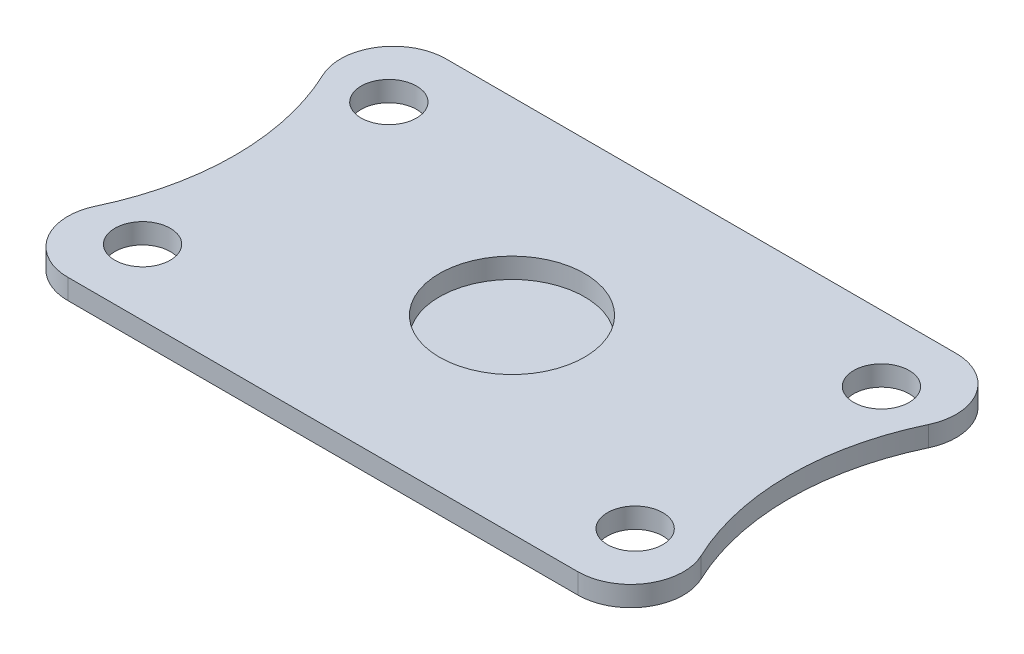
ISO-10303-21;
HEADER;
FILE_DESCRIPTION(('STEP AP214'),'2;1');
FILE_NAME('part.step','',(''),(''),'','','');
FILE_SCHEMA(('AUTOMOTIVE_DESIGN { 1 0 10303 214 1 1 1 1 }'));
ENDSEC;
DATA;
#1=APPLICATION_CONTEXT('core data for automotive mechanical design processes');
#2=APPLICATION_PROTOCOL_DEFINITION('international standard','automotive_design',2000,#1);
#3=PRODUCT_CONTEXT('',#1,'mechanical');
#4=PRODUCT('Part','Part','',(#3));
#5=PRODUCT_RELATED_PRODUCT_CATEGORY('part','',(#4));
#6=PRODUCT_DEFINITION_FORMATION('','',#4);
#7=PRODUCT_DEFINITION_CONTEXT('part definition',#1,'design');
#8=PRODUCT_DEFINITION('design','',#6,#7);
#9=PRODUCT_DEFINITION_SHAPE('','',#8);
#10=(LENGTH_UNIT() NAMED_UNIT(*) SI_UNIT(.MILLI.,.METRE.));
#11=(NAMED_UNIT(*) PLANE_ANGLE_UNIT() SI_UNIT($,.RADIAN.));
#12=(NAMED_UNIT(*) SI_UNIT($,.STERADIAN.) SOLID_ANGLE_UNIT());
#13=UNCERTAINTY_MEASURE_WITH_UNIT(LENGTH_MEASURE(1.E-05),#10,'distance_accuracy_value','');
#14=(GEOMETRIC_REPRESENTATION_CONTEXT(3) GLOBAL_UNCERTAINTY_ASSIGNED_CONTEXT((#13)) GLOBAL_UNIT_ASSIGNED_CONTEXT((#10,
#11,#12)) REPRESENTATION_CONTEXT('',''));
#15=CARTESIAN_POINT('',(0.,0.,0.));
#16=DIRECTION('',(0.,0.,1.));
#17=DIRECTION('',(1.,0.,0.));
#18=AXIS2_PLACEMENT_3D('',#15,#16,#17);
#19=CARTESIAN_POINT('',(-61.571428,2.3,0.));
#20=DIRECTION('',(0.,-1.,0.));
#21=DIRECTION('',(0.,0.,-1.));
#22=AXIS2_PLACEMENT_3D('',#19,#20,#21);
#23=CYLINDRICAL_SURFACE('',#22,30.0714280554455);
#24=CARTESIAN_POINT('',(-61.571428,0.,0.));
#25=DIRECTION('',(0.,1.,0.));
#26=DIRECTION('',(0.,0.,1.));
#27=AXIS2_PLACEMENT_3D('',#24,#25,#26);
#28=CIRCLE('',#27,30.0714280554455);
#29=CARTESIAN_POINT('',(-34.4178217988656,0.,12.9217822132844));
#30=VERTEX_POINT('',#29);
#31=CARTESIAN_POINT('',(-34.4178217988656,0.,-12.9217822132845));
#32=VERTEX_POINT('',#31);
#33=EDGE_CURVE('E147',#30,#32,#28,.T.);
#34=ORIENTED_EDGE('',*,*,#33,.F.);
#35=DIRECTION('',(0.,-1.,0.));
#36=VECTOR('',#35,1.);
#37=CARTESIAN_POINT('',(-34.4178217988656,2.3,12.9217822132844));
#38=LINE('',#37,#36);
#39=CARTESIAN_POINT('',(-34.4178217988656,2.3,12.9217822132844));
#40=VERTEX_POINT('',#39);
#41=EDGE_CURVE('E44',#40,#30,#38,.T.);
#42=ORIENTED_EDGE('',*,*,#41,.F.);
#43=CARTESIAN_POINT('',(-61.571428,2.3,0.));
#44=DIRECTION('',(0.,1.,0.));
#45=DIRECTION('',(0.,0.,1.));
#46=AXIS2_PLACEMENT_3D('',#43,#44,#45);
#47=CIRCLE('',#46,30.0714280554455);
#48=CARTESIAN_POINT('',(-34.4178217988656,2.3,-12.9217822132845));
#49=VERTEX_POINT('',#48);
#50=EDGE_CURVE('E269',#40,#49,#47,.T.);
#51=ORIENTED_EDGE('',*,*,#50,.T.);
#52=DIRECTION('',(0.,-1.,0.));
#53=VECTOR('',#52,1.);
#54=CARTESIAN_POINT('',(-34.4178217988656,2.3,-12.9217822132845));
#55=LINE('',#54,#53);
#56=EDGE_CURVE('E87',#49,#32,#55,.T.);
#57=ORIENTED_EDGE('',*,*,#56,.T.);
#58=EDGE_LOOP('',(#34,#42,#51,#57));
#59=FACE_BOUND('',#58,.T.);
#60=ADVANCED_FACE('F35',(#59),#23,.F.);
#61=CARTESIAN_POINT('',(-29.,2.3,15.5));
#62=DIRECTION('',(0.,-1.,0.));
#63=DIRECTION('',(0.,0.,-1.));
#64=AXIS2_PLACEMENT_3D('',#61,#62,#63);
#65=CYLINDRICAL_SURFACE('',#64,6.);
#66=CARTESIAN_POINT('',(-29.,0.,15.5));
#67=DIRECTION('',(0.,1.,0.));
#68=DIRECTION('',(0.,0.,1.));
#69=AXIS2_PLACEMENT_3D('',#66,#67,#68);
#70=CIRCLE('',#69,6.);
#71=CARTESIAN_POINT('',(-29.,0.,21.5));
#72=VERTEX_POINT('',#71);
#73=EDGE_CURVE('E150',#30,#72,#70,.T.);
#74=ORIENTED_EDGE('',*,*,#73,.T.);
#75=DIRECTION('',(0.,-1.,0.));
#76=VECTOR('',#75,1.);
#77=CARTESIAN_POINT('',(-29.,2.3,21.5));
#78=LINE('',#77,#76);
#79=CARTESIAN_POINT('',(-29.,2.3,21.5));
#80=VERTEX_POINT('',#79);
#81=EDGE_CURVE('E182',#80,#72,#78,.T.);
#82=ORIENTED_EDGE('',*,*,#81,.F.);
#83=CARTESIAN_POINT('',(-29.,2.3,15.5));
#84=DIRECTION('',(0.,1.,0.));
#85=DIRECTION('',(0.,0.,1.));
#86=AXIS2_PLACEMENT_3D('',#83,#84,#85);
#87=CIRCLE('',#86,6.);
#88=EDGE_CURVE('E189',#40,#80,#87,.T.);
#89=ORIENTED_EDGE('',*,*,#88,.F.);
#90=ORIENTED_EDGE('',*,*,#41,.T.);
#91=EDGE_LOOP('',(#74,#82,#89,#90));
#92=FACE_BOUND('',#91,.T.);
#93=ADVANCED_FACE('F186',(#92),#65,.T.);
#94=CARTESIAN_POINT('',(0.,2.3,21.5));
#95=DIRECTION('',(0.,0.,-1.));
#96=DIRECTION('',(-1.,0.,0.));
#97=AXIS2_PLACEMENT_3D('',#94,#95,#96);
#98=PLANE('',#97);
#99=DIRECTION('',(1.,0.,0.));
#100=VECTOR('',#99,1.);
#101=CARTESIAN_POINT('',(0.,0.,21.5));
#102=LINE('',#101,#100);
#103=CARTESIAN_POINT('',(29.,0.,21.5));
#104=VERTEX_POINT('',#103);
#105=EDGE_CURVE('E153',#72,#104,#102,.T.);
#106=ORIENTED_EDGE('',*,*,#105,.T.);
#107=DIRECTION('',(0.,-1.,0.));
#108=VECTOR('',#107,1.);
#109=CARTESIAN_POINT('',(29.,2.3,21.5));
#110=LINE('',#109,#108);
#111=CARTESIAN_POINT('',(29.,2.3,21.5));
#112=VERTEX_POINT('',#111);
#113=EDGE_CURVE('E179',#112,#104,#110,.T.);
#114=ORIENTED_EDGE('',*,*,#113,.F.);
#115=DIRECTION('',(1.,0.,0.));
#116=VECTOR('',#115,1.);
#117=CARTESIAN_POINT('',(0.,2.3,21.5));
#118=LINE('',#117,#116);
#119=EDGE_CURVE('E266',#80,#112,#118,.T.);
#120=ORIENTED_EDGE('',*,*,#119,.F.);
#121=ORIENTED_EDGE('',*,*,#81,.T.);
#122=EDGE_LOOP('',(#106,#114,#120,#121));
#123=FACE_BOUND('',#122,.T.);
#124=ADVANCED_FACE('F198',(#123),#98,.F.);
#125=CARTESIAN_POINT('',(29.,2.3,15.5));
#126=DIRECTION('',(0.,-1.,0.));
#127=DIRECTION('',(0.,0.,-1.));
#128=AXIS2_PLACEMENT_3D('',#125,#126,#127);
#129=CYLINDRICAL_SURFACE('',#128,6.);
#130=CARTESIAN_POINT('',(29.,0.,15.5));
#131=DIRECTION('',(0.,1.,0.));
#132=DIRECTION('',(0.,0.,1.));
#133=AXIS2_PLACEMENT_3D('',#130,#131,#132);
#134=CIRCLE('',#133,6.);
#135=CARTESIAN_POINT('',(34.4178217988656,0.,12.9217822132844));
#136=VERTEX_POINT('',#135);
#137=EDGE_CURVE('E156',#104,#136,#134,.T.);
#138=ORIENTED_EDGE('',*,*,#137,.T.);
#139=DIRECTION('',(0.,-1.,0.));
#140=VECTOR('',#139,1.);
#141=CARTESIAN_POINT('',(34.4178217988656,2.3,12.9217822132844));
#142=LINE('',#141,#140);
#143=CARTESIAN_POINT('',(34.4178217988656,2.3,12.9217822132844));
#144=VERTEX_POINT('',#143);
#145=EDGE_CURVE('E177',#144,#136,#142,.T.);
#146=ORIENTED_EDGE('',*,*,#145,.F.);
#147=CARTESIAN_POINT('',(29.,2.3,15.5));
#148=DIRECTION('',(0.,1.,0.));
#149=DIRECTION('',(0.,0.,1.));
#150=AXIS2_PLACEMENT_3D('',#147,#148,#149);
#151=CIRCLE('',#150,6.);
#152=EDGE_CURVE('E267',#112,#144,#151,.T.);
#153=ORIENTED_EDGE('',*,*,#152,.F.);
#154=ORIENTED_EDGE('',*,*,#113,.T.);
#155=EDGE_LOOP('',(#138,#146,#153,#154));
#156=FACE_BOUND('',#155,.T.);
#157=ADVANCED_FACE('F256',(#156),#129,.T.);
#158=CARTESIAN_POINT('',(61.571429,2.3,0.));
#159=DIRECTION('',(0.,-1.,0.));
#160=DIRECTION('',(0.,0.,-1.));
#161=AXIS2_PLACEMENT_3D('',#158,#159,#160);
#162=CYLINDRICAL_SURFACE('',#161,30.0714289584158);
#163=CARTESIAN_POINT('',(61.571429,0.,0.));
#164=DIRECTION('',(0.,1.,0.));
#165=DIRECTION('',(0.,0.,1.));
#166=AXIS2_PLACEMENT_3D('',#163,#164,#165);
#167=CIRCLE('',#166,30.0714289584158);
#168=CARTESIAN_POINT('',(34.4178217988656,0.,-12.9217822132845));
#169=VERTEX_POINT('',#168);
#170=EDGE_CURVE('E159',#169,#136,#167,.T.);
#171=ORIENTED_EDGE('',*,*,#170,.F.);
#172=DIRECTION('',(0.,-1.,0.));
#173=VECTOR('',#172,1.);
#174=CARTESIAN_POINT('',(34.4178217988656,2.3,-12.9217822132845));
#175=LINE('',#174,#173);
#176=CARTESIAN_POINT('',(34.4178217988656,2.3,-12.9217822132845));
#177=VERTEX_POINT('',#176);
#178=EDGE_CURVE('E124',#177,#169,#175,.T.);
#179=ORIENTED_EDGE('',*,*,#178,.F.);
#180=CARTESIAN_POINT('',(61.571429,2.3,0.));
#181=DIRECTION('',(0.,1.,0.));
#182=DIRECTION('',(0.,0.,1.));
#183=AXIS2_PLACEMENT_3D('',#180,#181,#182);
#184=CIRCLE('',#183,30.0714289584158);
#185=EDGE_CURVE('E113',#177,#144,#184,.T.);
#186=ORIENTED_EDGE('',*,*,#185,.T.);
#187=ORIENTED_EDGE('',*,*,#145,.T.);
#188=EDGE_LOOP('',(#171,#179,#186,#187));
#189=FACE_BOUND('',#188,.T.);
#190=ADVANCED_FACE('F253',(#189),#162,.F.);
#191=CARTESIAN_POINT('',(29.,2.3,-15.5));
#192=DIRECTION('',(0.,-1.,0.));
#193=DIRECTION('',(0.,0.,-1.));
#194=AXIS2_PLACEMENT_3D('',#191,#192,#193);
#195=CYLINDRICAL_SURFACE('',#194,6.);
#196=CARTESIAN_POINT('',(29.,0.,-15.5));
#197=DIRECTION('',(0.,1.,0.));
#198=DIRECTION('',(0.,0.,1.));
#199=AXIS2_PLACEMENT_3D('',#196,#197,#198);
#200=CIRCLE('',#199,6.);
#201=CARTESIAN_POINT('',(29.,0.,-21.5));
#202=VERTEX_POINT('',#201);
#203=EDGE_CURVE('E120',#169,#202,#200,.T.);
#204=ORIENTED_EDGE('',*,*,#203,.T.);
#205=DIRECTION('',(0.,-1.,0.));
#206=VECTOR('',#205,1.);
#207=CARTESIAN_POINT('',(29.,2.3,-21.5));
#208=LINE('',#207,#206);
#209=CARTESIAN_POINT('',(29.,2.3,-21.5));
#210=VERTEX_POINT('',#209);
#211=EDGE_CURVE('E117',#210,#202,#208,.T.);
#212=ORIENTED_EDGE('',*,*,#211,.F.);
#213=CARTESIAN_POINT('',(29.,2.3,-15.5));
#214=DIRECTION('',(0.,1.,0.));
#215=DIRECTION('',(0.,0.,1.));
#216=AXIS2_PLACEMENT_3D('',#213,#214,#215);
#217=CIRCLE('',#216,6.);
#218=EDGE_CURVE('E106',#177,#210,#217,.T.);
#219=ORIENTED_EDGE('',*,*,#218,.F.);
#220=ORIENTED_EDGE('',*,*,#178,.T.);
#221=EDGE_LOOP('',(#204,#212,#219,#220));
#222=FACE_BOUND('',#221,.T.);
#223=ADVANCED_FACE('F118',(#222),#195,.T.);
#224=CARTESIAN_POINT('',(0.,2.3,-21.5));
#225=DIRECTION('',(0.,0.,-1.));
#226=DIRECTION('',(-1.,0.,0.));
#227=AXIS2_PLACEMENT_3D('',#224,#225,#226);
#228=PLANE('',#227);
#229=DIRECTION('',(1.,0.,0.));
#230=VECTOR('',#229,1.);
#231=CARTESIAN_POINT('',(0.,0.,-21.5));
#232=LINE('',#231,#230);
#233=CARTESIAN_POINT('',(-29.,0.,-21.5));
#234=VERTEX_POINT('',#233);
#235=EDGE_CURVE('E163',#234,#202,#232,.T.);
#236=ORIENTED_EDGE('',*,*,#235,.F.);
#237=DIRECTION('',(0.,-1.,0.));
#238=VECTOR('',#237,1.);
#239=CARTESIAN_POINT('',(-29.,2.3,-21.5));
#240=LINE('',#239,#238);
#241=CARTESIAN_POINT('',(-29.,2.3,-21.5));
#242=VERTEX_POINT('',#241);
#243=EDGE_CURVE('E80',#242,#234,#240,.T.);
#244=ORIENTED_EDGE('',*,*,#243,.F.);
#245=DIRECTION('',(1.,0.,0.));
#246=VECTOR('',#245,1.);
#247=CARTESIAN_POINT('',(0.,2.3,-21.5));
#248=LINE('',#247,#246);
#249=EDGE_CURVE('E111',#242,#210,#248,.T.);
#250=ORIENTED_EDGE('',*,*,#249,.T.);
#251=ORIENTED_EDGE('',*,*,#211,.T.);
#252=EDGE_LOOP('',(#236,#244,#250,#251));
#253=FACE_BOUND('',#252,.T.);
#254=ADVANCED_FACE('F126',(#253),#228,.T.);
#255=CARTESIAN_POINT('',(-28.,2.3,-14.));
#256=DIRECTION('',(0.,-1.,0.));
#257=DIRECTION('',(0.,0.,-1.));
#258=AXIS2_PLACEMENT_3D('',#255,#256,#257);
#259=CYLINDRICAL_SURFACE('',#258,3.14999999999997);
#260=CARTESIAN_POINT('',(-28.,2.3,-14.));
#261=DIRECTION('',(0.,1.,0.));
#262=DIRECTION('',(0.,0.,1.));
#263=AXIS2_PLACEMENT_3D('',#260,#261,#262);
#264=CIRCLE('',#263,3.14999999999997);
#265=CARTESIAN_POINT('',(-28.,2.3,-10.85));
#266=VERTEX_POINT('',#265);
#267=EDGE_CURVE('E128',#266,#266,#264,.T.);
#268=ORIENTED_EDGE('',*,*,#267,.T.);
#269=EDGE_LOOP('',(#268));
#270=FACE_BOUND('',#269,.T.);
#271=CARTESIAN_POINT('',(-28.,0.,-14.));
#272=DIRECTION('',(0.,1.,0.));
#273=DIRECTION('',(0.,0.,1.));
#274=AXIS2_PLACEMENT_3D('',#271,#272,#273);
#275=CIRCLE('',#274,3.14999999999997);
#276=CARTESIAN_POINT('',(-28.,0.,-10.85));
#277=VERTEX_POINT('',#276);
#278=EDGE_CURVE('E167',#277,#277,#275,.T.);
#279=ORIENTED_EDGE('',*,*,#278,.F.);
#280=EDGE_LOOP('',(#279));
#281=FACE_BOUND('',#280,.T.);
#282=ADVANCED_FACE('F243',(#270,#281),#259,.F.);
#283=CARTESIAN_POINT('',(-29.,2.3,-15.5));
#284=DIRECTION('',(0.,-1.,0.));
#285=DIRECTION('',(0.,0.,-1.));
#286=AXIS2_PLACEMENT_3D('',#283,#284,#285);
#287=CYLINDRICAL_SURFACE('',#286,6.);
#288=CARTESIAN_POINT('',(-29.,0.,-15.5));
#289=DIRECTION('',(0.,1.,0.));
#290=DIRECTION('',(0.,0.,1.));
#291=AXIS2_PLACEMENT_3D('',#288,#289,#290);
#292=CIRCLE('',#291,6.);
#293=EDGE_CURVE('E165',#234,#32,#292,.T.);
#294=ORIENTED_EDGE('',*,*,#293,.T.);
#295=ORIENTED_EDGE('',*,*,#56,.F.);
#296=CARTESIAN_POINT('',(-29.,2.3,-15.5));
#297=DIRECTION('',(0.,1.,0.));
#298=DIRECTION('',(0.,0.,1.));
#299=AXIS2_PLACEMENT_3D('',#296,#297,#298);
#300=CIRCLE('',#299,6.);
#301=EDGE_CURVE('E52',#242,#49,#300,.T.);
#302=ORIENTED_EDGE('',*,*,#301,.F.);
#303=ORIENTED_EDGE('',*,*,#243,.T.);
#304=EDGE_LOOP('',(#294,#295,#302,#303));
#305=FACE_BOUND('',#304,.T.);
#306=ADVANCED_FACE('F205',(#305),#287,.T.);
#307=CARTESIAN_POINT('',(28.,2.3,14.));
#308=DIRECTION('',(0.,-1.,0.));
#309=DIRECTION('',(0.,0.,-1.));
#310=AXIS2_PLACEMENT_3D('',#307,#308,#309);
#311=CYLINDRICAL_SURFACE('',#310,3.14999999999999);
#312=CARTESIAN_POINT('',(28.,2.3,14.));
#313=DIRECTION('',(0.,1.,0.));
#314=DIRECTION('',(0.,0.,1.));
#315=AXIS2_PLACEMENT_3D('',#312,#313,#314);
#316=CIRCLE('',#315,3.14999999999999);
#317=CARTESIAN_POINT('',(28.,2.3,17.1499999999999));
#318=VERTEX_POINT('',#317);
#319=EDGE_CURVE('E271',#318,#318,#316,.T.);
#320=ORIENTED_EDGE('',*,*,#319,.T.);
#321=EDGE_LOOP('',(#320));
#322=FACE_BOUND('',#321,.T.);
#323=CARTESIAN_POINT('',(28.,0.,14.));
#324=DIRECTION('',(0.,1.,0.));
#325=DIRECTION('',(0.,0.,1.));
#326=AXIS2_PLACEMENT_3D('',#323,#324,#325);
#327=CIRCLE('',#326,3.14999999999999);
#328=CARTESIAN_POINT('',(28.,0.,17.1499999999999));
#329=VERTEX_POINT('',#328);
#330=EDGE_CURVE('E144',#329,#329,#327,.T.);
#331=ORIENTED_EDGE('',*,*,#330,.F.);
#332=EDGE_LOOP('',(#331));
#333=FACE_BOUND('',#332,.T.);
#334=ADVANCED_FACE('F202',(#322,#333),#311,.F.);
#335=CARTESIAN_POINT('',(28.,2.3,-14.));
#336=DIRECTION('',(0.,-1.,0.));
#337=DIRECTION('',(0.,0.,-1.));
#338=AXIS2_PLACEMENT_3D('',#335,#336,#337);
#339=CYLINDRICAL_SURFACE('',#338,3.14999999999999);
#340=CARTESIAN_POINT('',(28.,2.3,-14.));
#341=DIRECTION('',(0.,1.,0.));
#342=DIRECTION('',(0.,0.,1.));
#343=AXIS2_PLACEMENT_3D('',#340,#341,#342);
#344=CIRCLE('',#343,3.14999999999999);
#345=CARTESIAN_POINT('',(28.,2.3,-10.85));
#346=VERTEX_POINT('',#345);
#347=EDGE_CURVE('E217',#346,#346,#344,.T.);
#348=ORIENTED_EDGE('',*,*,#347,.T.);
#349=EDGE_LOOP('',(#348));
#350=FACE_BOUND('',#349,.T.);
#351=CARTESIAN_POINT('',(28.,0.,-14.));
#352=DIRECTION('',(0.,1.,0.));
#353=DIRECTION('',(0.,0.,1.));
#354=AXIS2_PLACEMENT_3D('',#351,#352,#353);
#355=CIRCLE('',#354,3.14999999999999);
#356=CARTESIAN_POINT('',(28.,0.,-10.85));
#357=VERTEX_POINT('',#356);
#358=EDGE_CURVE('E140',#357,#357,#355,.T.);
#359=ORIENTED_EDGE('',*,*,#358,.F.);
#360=EDGE_LOOP('',(#359));
#361=FACE_BOUND('',#360,.T.);
#362=ADVANCED_FACE('F204',(#350,#361),#339,.F.);
#363=CARTESIAN_POINT('',(-28.,2.3,14.));
#364=DIRECTION('',(0.,-1.,0.));
#365=DIRECTION('',(0.,0.,-1.));
#366=AXIS2_PLACEMENT_3D('',#363,#364,#365);
#367=CYLINDRICAL_SURFACE('',#366,3.14999999999997);
#368=CARTESIAN_POINT('',(-28.,2.3,14.));
#369=DIRECTION('',(0.,1.,0.));
#370=DIRECTION('',(0.,0.,1.));
#371=AXIS2_PLACEMENT_3D('',#368,#369,#370);
#372=CIRCLE('',#371,3.14999999999997);
#373=CARTESIAN_POINT('',(-28.,2.3,17.1499999999999));
#374=VERTEX_POINT('',#373);
#375=EDGE_CURVE('E173',#374,#374,#372,.T.);
#376=ORIENTED_EDGE('',*,*,#375,.T.);
#377=EDGE_LOOP('',(#376));
#378=FACE_BOUND('',#377,.T.);
#379=CARTESIAN_POINT('',(-28.,0.,14.));
#380=DIRECTION('',(0.,1.,0.));
#381=DIRECTION('',(0.,0.,1.));
#382=AXIS2_PLACEMENT_3D('',#379,#380,#381);
#383=CIRCLE('',#382,3.14999999999997);
#384=CARTESIAN_POINT('',(-28.,0.,17.1499999999999));
#385=VERTEX_POINT('',#384);
#386=EDGE_CURVE('E137',#385,#385,#383,.T.);
#387=ORIENTED_EDGE('',*,*,#386,.F.);
#388=EDGE_LOOP('',(#387));
#389=FACE_BOUND('',#388,.T.);
#390=ADVANCED_FACE('F37',(#378,#389),#367,.F.);
#391=CARTESIAN_POINT('',(0.,2.3,0.));
#392=DIRECTION('',(0.,-1.,0.));
#393=DIRECTION('',(0.,0.,-1.));
#394=AXIS2_PLACEMENT_3D('',#391,#392,#393);
#395=CYLINDRICAL_SURFACE('',#394,8.24999999999999);
#396=CARTESIAN_POINT('',(0.,2.3,0.));
#397=DIRECTION('',(0.,1.,0.));
#398=DIRECTION('',(0.,0.,1.));
#399=AXIS2_PLACEMENT_3D('',#396,#397,#398);
#400=CIRCLE('',#399,8.24999999999999);
#401=CARTESIAN_POINT('',(0.,2.3,8.24999999999999));
#402=VERTEX_POINT('',#401);
#403=EDGE_CURVE('E134',#402,#402,#400,.T.);
#404=ORIENTED_EDGE('',*,*,#403,.T.);
#405=EDGE_LOOP('',(#404));
#406=FACE_BOUND('',#405,.T.);
#407=CARTESIAN_POINT('',(0.,0.,0.));
#408=DIRECTION('',(0.,1.,0.));
#409=DIRECTION('',(0.,0.,1.));
#410=AXIS2_PLACEMENT_3D('',#407,#408,#409);
#411=CIRCLE('',#410,8.24999999999999);
#412=CARTESIAN_POINT('',(0.,0.,8.24999999999999));
#413=VERTEX_POINT('',#412);
#414=EDGE_CURVE('E170',#413,#413,#411,.T.);
#415=ORIENTED_EDGE('',*,*,#414,.F.);
#416=EDGE_LOOP('',(#415));
#417=FACE_BOUND('',#416,.T.);
#418=ADVANCED_FACE('F212',(#406,#417),#395,.F.);
#419=CARTESIAN_POINT('',(0.,2.3,0.));
#420=DIRECTION('',(0.,1.,0.));
#421=DIRECTION('',(0.,0.,1.));
#422=AXIS2_PLACEMENT_3D('',#419,#420,#421);
#423=PLANE('',#422);
#424=ORIENTED_EDGE('',*,*,#375,.F.);
#425=EDGE_LOOP('',(#424));
#426=FACE_BOUND('',#425,.T.);
#427=ORIENTED_EDGE('',*,*,#347,.F.);
#428=EDGE_LOOP('',(#427));
#429=FACE_BOUND('',#428,.T.);
#430=ORIENTED_EDGE('',*,*,#319,.F.);
#431=EDGE_LOOP('',(#430));
#432=FACE_BOUND('',#431,.T.);
#433=ORIENTED_EDGE('',*,*,#50,.F.);
#434=ORIENTED_EDGE('',*,*,#88,.T.);
#435=ORIENTED_EDGE('',*,*,#119,.T.);
#436=ORIENTED_EDGE('',*,*,#152,.T.);
#437=ORIENTED_EDGE('',*,*,#185,.F.);
#438=ORIENTED_EDGE('',*,*,#218,.T.);
#439=ORIENTED_EDGE('',*,*,#249,.F.);
#440=ORIENTED_EDGE('',*,*,#301,.T.);
#441=EDGE_LOOP('',(#433,#434,#435,#436,#437,#438,#439,#440));
#442=FACE_BOUND('',#441,.T.);
#443=ORIENTED_EDGE('',*,*,#267,.F.);
#444=EDGE_LOOP('',(#443));
#445=FACE_BOUND('',#444,.T.);
#446=ORIENTED_EDGE('',*,*,#403,.F.);
#447=EDGE_LOOP('',(#446));
#448=FACE_BOUND('',#447,.T.);
#449=ADVANCED_FACE('F108',(#426,#429,#432,#442,#445,#448),#423,.T.);
#450=CARTESIAN_POINT('',(0.,0.,0.));
#451=DIRECTION('',(0.,1.,0.));
#452=DIRECTION('',(0.,0.,1.));
#453=AXIS2_PLACEMENT_3D('',#450,#451,#452);
#454=PLANE('',#453);
#455=CARTESIAN_POINT('',(0.,0.,0.));
#456=DIRECTION('',(0.,1.,0.));
#457=DIRECTION('',(-1.,0.,0.));
#458=AXIS2_PLACEMENT_3D('',#455,#456,#457);
#459=CIRCLE('',#458,13.);
#460=CARTESIAN_POINT('',(-13.,0.,0.));
#461=VERTEX_POINT('',#460);
#462=EDGE_CURVE('E11',#461,#461,#459,.F.);
#463=ORIENTED_EDGE('',*,*,#462,.F.);
#464=EDGE_LOOP('',(#463));
#465=FACE_BOUND('',#464,.T.);
#466=ORIENTED_EDGE('',*,*,#386,.T.);
#467=EDGE_LOOP('',(#466));
#468=FACE_BOUND('',#467,.T.);
#469=ORIENTED_EDGE('',*,*,#358,.T.);
#470=EDGE_LOOP('',(#469));
#471=FACE_BOUND('',#470,.T.);
#472=ORIENTED_EDGE('',*,*,#330,.T.);
#473=EDGE_LOOP('',(#472));
#474=FACE_BOUND('',#473,.T.);
#475=ORIENTED_EDGE('',*,*,#33,.T.);
#476=ORIENTED_EDGE('',*,*,#293,.F.);
#477=ORIENTED_EDGE('',*,*,#235,.T.);
#478=ORIENTED_EDGE('',*,*,#203,.F.);
#479=ORIENTED_EDGE('',*,*,#170,.T.);
#480=ORIENTED_EDGE('',*,*,#137,.F.);
#481=ORIENTED_EDGE('',*,*,#105,.F.);
#482=ORIENTED_EDGE('',*,*,#73,.F.);
#483=EDGE_LOOP('',(#475,#476,#477,#478,#479,#480,#481,#482));
#484=FACE_BOUND('',#483,.T.);
#485=ORIENTED_EDGE('',*,*,#278,.T.);
#486=EDGE_LOOP('',(#485));
#487=FACE_BOUND('',#486,.T.);
#488=ADVANCED_FACE('F191',(#465,#468,#471,#474,#484,#487),#454,.F.);
#489=CARTESIAN_POINT('',(0.,-3.,0.));
#490=DIRECTION('',(0.,1.,0.));
#491=DIRECTION('',(-1.,0.,0.));
#492=AXIS2_PLACEMENT_3D('',#489,#490,#491);
#493=TOROIDAL_SURFACE('',#492,13.,3.);
#494=ORIENTED_EDGE('',*,*,#462,.T.);
#495=EDGE_LOOP('',(#494));
#496=FACE_BOUND('',#495,.T.);
#497=CARTESIAN_POINT('',(0.,-3.,0.));
#498=DIRECTION('',(0.,1.,0.));
#499=DIRECTION('',(-1.,0.,0.));
#500=AXIS2_PLACEMENT_3D('',#497,#498,#499);
#501=CIRCLE('',#500,16.);
#502=CARTESIAN_POINT('',(-16.,-3.,0.));
#503=VERTEX_POINT('',#502);
#504=EDGE_CURVE('E284',#503,#503,#501,.T.);
#505=ORIENTED_EDGE('',*,*,#504,.T.);
#506=EDGE_LOOP('',(#505));
#507=FACE_BOUND('',#506,.T.);
#508=ADVANCED_FACE('F222',(#496,#507),#493,.T.);
#509=CARTESIAN_POINT('',(0.,0.,0.));
#510=DIRECTION('',(0.,1.,0.));
#511=DIRECTION('',(-1.,0.,0.));
#512=AXIS2_PLACEMENT_3D('',#509,#510,#511);
#513=CYLINDRICAL_SURFACE('',#512,16.);
#514=CARTESIAN_POINT('',(0.,-4.,0.));
#515=DIRECTION('',(0.,1.,0.));
#516=DIRECTION('',(-1.,0.,0.));
#517=AXIS2_PLACEMENT_3D('',#514,#515,#516);
#518=CIRCLE('',#517,16.);
#519=CARTESIAN_POINT('',(-16.,-4.,0.));
#520=VERTEX_POINT('',#519);
#521=EDGE_CURVE('E141',#520,#520,#518,.T.);
#522=ORIENTED_EDGE('',*,*,#521,.T.);
#523=EDGE_LOOP('',(#522));
#524=FACE_BOUND('',#523,.T.);
#525=ORIENTED_EDGE('',*,*,#504,.F.);
#526=EDGE_LOOP('',(#525));
#527=FACE_BOUND('',#526,.T.);
#528=ADVANCED_FACE('F231',(#524,#527),#513,.T.);
#529=CARTESIAN_POINT('',(0.,-4.,0.));
#530=DIRECTION('',(0.,1.,0.));
#531=DIRECTION('',(-1.,0.,0.));
#532=AXIS2_PLACEMENT_3D('',#529,#530,#531);
#533=PLANE('',#532);
#534=ORIENTED_EDGE('',*,*,#521,.F.);
#535=EDGE_LOOP('',(#534));
#536=FACE_BOUND('',#535,.T.);
#537=ADVANCED_FACE('F290',(#536),#533,.F.);
#538=CARTESIAN_POINT('',(0.,0.,0.));
#539=DIRECTION('',(0.,1.,0.));
#540=DIRECTION('',(-1.,0.,0.));
#541=AXIS2_PLACEMENT_3D('',#538,#539,#540);
#542=PLANE('',#541);
#543=ORIENTED_EDGE('',*,*,#414,.T.);
#544=EDGE_LOOP('',(#543));
#545=FACE_BOUND('',#544,.T.);
#546=ADVANCED_FACE('F296',(#545),#542,.T.);
#547=CLOSED_SHELL('',(#60,#93,#124,#157,#190,#223,#254,#282,#306,#334,#362,#390,#418,#449,#488,
#508,#528,#537,#546));
#548=MANIFOLD_SOLID_BREP('B2',#547);
#549=ADVANCED_BREP_SHAPE_REPRESENTATION('',(#18,#548),#14);
#550=SHAPE_DEFINITION_REPRESENTATION(#9,#549);
ENDSEC;
END-ISO-10303-21;
